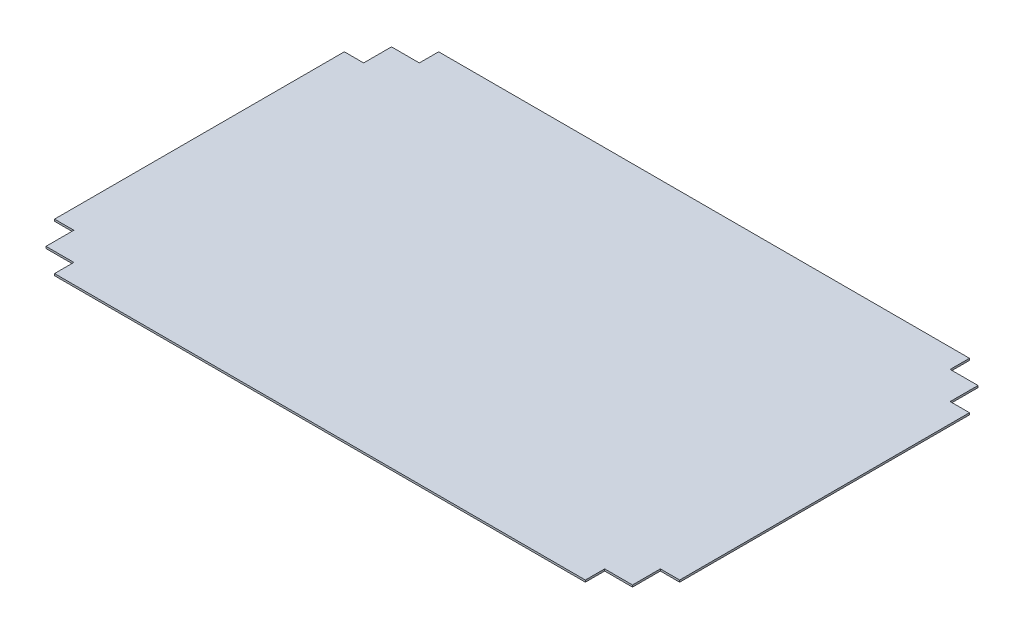
ISO-10303-21;
HEADER;
FILE_DESCRIPTION(('STEP AP214'),'2;1');
FILE_NAME('part.step','',(''),(''),'','','');
FILE_SCHEMA(('AUTOMOTIVE_DESIGN { 1 0 10303 214 1 1 1 1 }'));
ENDSEC;
DATA;
#1=APPLICATION_CONTEXT('core data for automotive mechanical design processes');
#2=APPLICATION_PROTOCOL_DEFINITION('international standard','automotive_design',2000,#1);
#3=PRODUCT_CONTEXT('',#1,'mechanical');
#4=PRODUCT('Part','Part','',(#3));
#5=PRODUCT_RELATED_PRODUCT_CATEGORY('part','',(#4));
#6=PRODUCT_DEFINITION_FORMATION('','',#4);
#7=PRODUCT_DEFINITION_CONTEXT('part definition',#1,'design');
#8=PRODUCT_DEFINITION('design','',#6,#7);
#9=PRODUCT_DEFINITION_SHAPE('','',#8);
#10=(LENGTH_UNIT() NAMED_UNIT(*) SI_UNIT(.MILLI.,.METRE.));
#11=(NAMED_UNIT(*) PLANE_ANGLE_UNIT() SI_UNIT($,.RADIAN.));
#12=(NAMED_UNIT(*) SI_UNIT($,.STERADIAN.) SOLID_ANGLE_UNIT());
#13=UNCERTAINTY_MEASURE_WITH_UNIT(LENGTH_MEASURE(1.E-05),#10,'distance_accuracy_value','');
#14=(GEOMETRIC_REPRESENTATION_CONTEXT(3) GLOBAL_UNCERTAINTY_ASSIGNED_CONTEXT((#13)) GLOBAL_UNIT_ASSIGNED_CONTEXT((#10,
#11,#12)) REPRESENTATION_CONTEXT('',''));
#15=CARTESIAN_POINT('',(0.,0.,0.));
#16=DIRECTION('',(0.,0.,1.));
#17=DIRECTION('',(1.,0.,0.));
#18=AXIS2_PLACEMENT_3D('',#15,#16,#17);
#19=CARTESIAN_POINT('',(-325.499342602982,2.,150.901091601542));
#20=DIRECTION('',(1.,0.,0.));
#21=DIRECTION('',(0.,0.,-1.));
#22=AXIS2_PLACEMENT_3D('',#19,#20,#21);
#23=PLANE('',#22);
#24=DIRECTION('',(0.,0.,1.));
#25=VECTOR('',#24,1.);
#26=CARTESIAN_POINT('',(-325.499342602982,0.,150.901091601542));
#27=LINE('',#26,#25);
#28=CARTESIAN_POINT('',(-325.499342602982,0.,-150.901111001535));
#29=VERTEX_POINT('',#28);
#30=CARTESIAN_POINT('',(-325.499342602982,0.,150.901091601542));
#31=VERTEX_POINT('',#30);
#32=EDGE_CURVE('E202',#29,#31,#27,.T.);
#33=ORIENTED_EDGE('',*,*,#32,.T.);
#34=DIRECTION('',(0.,-1.,0.));
#35=VECTOR('',#34,1.);
#36=CARTESIAN_POINT('',(-325.499342602982,2.,150.901091601542));
#37=LINE('',#36,#35);
#38=CARTESIAN_POINT('',(-325.499342602982,2.,150.901091601542));
#39=VERTEX_POINT('',#38);
#40=EDGE_CURVE('E11',#39,#31,#37,.T.);
#41=ORIENTED_EDGE('',*,*,#40,.F.);
#42=DIRECTION('',(0.,0.,1.));
#43=VECTOR('',#42,1.);
#44=CARTESIAN_POINT('',(-325.499342602982,2.,150.901091601542));
#45=LINE('',#44,#43);
#46=CARTESIAN_POINT('',(-325.499342602982,2.,-150.901111001535));
#47=VERTEX_POINT('',#46);
#48=EDGE_CURVE('E241',#47,#39,#45,.T.);
#49=ORIENTED_EDGE('',*,*,#48,.F.);
#50=DIRECTION('',(0.,-1.,0.));
#51=VECTOR('',#50,1.);
#52=CARTESIAN_POINT('',(-325.499342602982,2.,-150.901111001535));
#53=LINE('',#52,#51);
#54=EDGE_CURVE('E198',#47,#29,#53,.T.);
#55=ORIENTED_EDGE('',*,*,#54,.T.);
#56=EDGE_LOOP('',(#33,#41,#49,#55));
#57=FACE_BOUND('',#56,.T.);
#58=ADVANCED_FACE('F33',(#57),#23,.F.);
#59=CARTESIAN_POINT('',(-305.400657397017,2.,150.901091601542));
#60=DIRECTION('',(0.,0.,-1.));
#61=DIRECTION('',(-1.,0.,0.));
#62=AXIS2_PLACEMENT_3D('',#59,#60,#61);
#63=PLANE('',#62);
#64=DIRECTION('',(1.,0.,0.));
#65=VECTOR('',#64,1.);
#66=CARTESIAN_POINT('',(-305.400657397017,0.,150.901091601542));
#67=LINE('',#66,#65);
#68=CARTESIAN_POINT('',(-305.400657397017,0.,150.901091601542));
#69=VERTEX_POINT('',#68);
#70=EDGE_CURVE('E205',#31,#69,#67,.T.);
#71=ORIENTED_EDGE('',*,*,#70,.T.);
#72=DIRECTION('',(0.,-1.,0.));
#73=VECTOR('',#72,1.);
#74=CARTESIAN_POINT('',(-305.400657397017,2.,150.901091601542));
#75=LINE('',#74,#73);
#76=CARTESIAN_POINT('',(-305.400657397017,2.,150.901091601542));
#77=VERTEX_POINT('',#76);
#78=EDGE_CURVE('E41',#77,#69,#75,.T.);
#79=ORIENTED_EDGE('',*,*,#78,.F.);
#80=DIRECTION('',(1.,0.,0.));
#81=VECTOR('',#80,1.);
#82=CARTESIAN_POINT('',(-305.400657397017,2.,150.901091601542));
#83=LINE('',#82,#81);
#84=EDGE_CURVE('E126',#39,#77,#83,.T.);
#85=ORIENTED_EDGE('',*,*,#84,.F.);
#86=ORIENTED_EDGE('',*,*,#40,.T.);
#87=EDGE_LOOP('',(#71,#79,#85,#86));
#88=FACE_BOUND('',#87,.T.);
#89=ADVANCED_FACE('F349',(#88),#63,.F.);
#90=CARTESIAN_POINT('',(-305.400657397017,2.,179.901091601542));
#91=DIRECTION('',(1.,0.,0.));
#92=DIRECTION('',(0.,0.,-1.));
#93=AXIS2_PLACEMENT_3D('',#90,#91,#92);
#94=PLANE('',#93);
#95=DIRECTION('',(0.,0.,1.));
#96=VECTOR('',#95,1.);
#97=CARTESIAN_POINT('',(-305.400657397017,0.,179.901091601542));
#98=LINE('',#97,#96);
#99=CARTESIAN_POINT('',(-305.400657397017,0.,179.901091601542));
#100=VERTEX_POINT('',#99);
#101=EDGE_CURVE('E207',#69,#100,#98,.T.);
#102=ORIENTED_EDGE('',*,*,#101,.T.);
#103=DIRECTION('',(0.,-1.,0.));
#104=VECTOR('',#103,1.);
#105=CARTESIAN_POINT('',(-305.400657397017,2.,179.901091601542));
#106=LINE('',#105,#104);
#107=CARTESIAN_POINT('',(-305.400657397017,2.,179.901091601542));
#108=VERTEX_POINT('',#107);
#109=EDGE_CURVE('E284',#108,#100,#106,.T.);
#110=ORIENTED_EDGE('',*,*,#109,.F.);
#111=DIRECTION('',(0.,0.,1.));
#112=VECTOR('',#111,1.);
#113=CARTESIAN_POINT('',(-305.400657397017,2.,179.901091601542));
#114=LINE('',#113,#112);
#115=EDGE_CURVE('E292',#77,#108,#114,.T.);
#116=ORIENTED_EDGE('',*,*,#115,.F.);
#117=ORIENTED_EDGE('',*,*,#78,.T.);
#118=EDGE_LOOP('',(#102,#110,#116,#117));
#119=FACE_BOUND('',#118,.T.);
#120=ADVANCED_FACE('F290',(#119),#94,.F.);
#121=CARTESIAN_POINT('',(-276.400657397017,2.,179.901091601542));
#122=DIRECTION('',(0.,0.,-1.));
#123=DIRECTION('',(-1.,0.,0.));
#124=AXIS2_PLACEMENT_3D('',#121,#122,#123);
#125=PLANE('',#124);
#126=DIRECTION('',(1.,0.,0.));
#127=VECTOR('',#126,1.);
#128=CARTESIAN_POINT('',(-276.400657397017,0.,179.901091601542));
#129=LINE('',#128,#127);
#130=CARTESIAN_POINT('',(-276.400657397017,0.,179.901091601542));
#131=VERTEX_POINT('',#130);
#132=EDGE_CURVE('E209',#100,#131,#129,.T.);
#133=ORIENTED_EDGE('',*,*,#132,.T.);
#134=DIRECTION('',(0.,-1.,0.));
#135=VECTOR('',#134,1.);
#136=CARTESIAN_POINT('',(-276.400657397017,2.,179.901091601542));
#137=LINE('',#136,#135);
#138=CARTESIAN_POINT('',(-276.400657397017,2.,179.901091601542));
#139=VERTEX_POINT('',#138);
#140=EDGE_CURVE('E281',#139,#131,#137,.T.);
#141=ORIENTED_EDGE('',*,*,#140,.F.);
#142=DIRECTION('',(1.,0.,0.));
#143=VECTOR('',#142,1.);
#144=CARTESIAN_POINT('',(-276.400657397017,2.,179.901091601542));
#145=LINE('',#144,#143);
#146=EDGE_CURVE('E308',#108,#139,#145,.T.);
#147=ORIENTED_EDGE('',*,*,#146,.F.);
#148=ORIENTED_EDGE('',*,*,#109,.T.);
#149=EDGE_LOOP('',(#133,#141,#147,#148));
#150=FACE_BOUND('',#149,.T.);
#151=ADVANCED_FACE('F299',(#150),#125,.F.);
#152=CARTESIAN_POINT('',(-276.400657397017,2.,199.998908398458));
#153=DIRECTION('',(1.,0.,0.));
#154=DIRECTION('',(0.,0.,-1.));
#155=AXIS2_PLACEMENT_3D('',#152,#153,#154);
#156=PLANE('',#155);
#157=DIRECTION('',(0.,0.,1.));
#158=VECTOR('',#157,1.);
#159=CARTESIAN_POINT('',(-276.400657397017,0.,199.998908398458));
#160=LINE('',#159,#158);
#161=CARTESIAN_POINT('',(-276.400657397017,0.,199.998908398458));
#162=VERTEX_POINT('',#161);
#163=EDGE_CURVE('E211',#131,#162,#160,.T.);
#164=ORIENTED_EDGE('',*,*,#163,.T.);
#165=DIRECTION('',(0.,-1.,0.));
#166=VECTOR('',#165,1.);
#167=CARTESIAN_POINT('',(-276.400657397017,2.,199.998908398458));
#168=LINE('',#167,#166);
#169=CARTESIAN_POINT('',(-276.400657397017,2.,199.998908398458));
#170=VERTEX_POINT('',#169);
#171=EDGE_CURVE('E278',#170,#162,#168,.T.);
#172=ORIENTED_EDGE('',*,*,#171,.F.);
#173=DIRECTION('',(0.,0.,1.));
#174=VECTOR('',#173,1.);
#175=CARTESIAN_POINT('',(-276.400657397017,2.,199.998908398458));
#176=LINE('',#175,#174);
#177=EDGE_CURVE('E305',#139,#170,#176,.T.);
#178=ORIENTED_EDGE('',*,*,#177,.F.);
#179=ORIENTED_EDGE('',*,*,#140,.T.);
#180=EDGE_LOOP('',(#164,#172,#178,#179));
#181=FACE_BOUND('',#180,.T.);
#182=ADVANCED_FACE('F303',(#181),#156,.F.);
#183=CARTESIAN_POINT('',(276.400657397018,2.,199.998908398458));
#184=DIRECTION('',(0.,0.,-1.));
#185=DIRECTION('',(-1.,0.,0.));
#186=AXIS2_PLACEMENT_3D('',#183,#184,#185);
#187=PLANE('',#186);
#188=DIRECTION('',(1.,0.,0.));
#189=VECTOR('',#188,1.);
#190=CARTESIAN_POINT('',(276.400657397018,0.,199.998908398458));
#191=LINE('',#190,#189);
#192=CARTESIAN_POINT('',(276.400657397018,0.,199.998908398458));
#193=VERTEX_POINT('',#192);
#194=EDGE_CURVE('E213',#162,#193,#191,.T.);
#195=ORIENTED_EDGE('',*,*,#194,.T.);
#196=DIRECTION('',(0.,-1.,0.));
#197=VECTOR('',#196,1.);
#198=CARTESIAN_POINT('',(276.400657397018,2.,199.998908398458));
#199=LINE('',#198,#197);
#200=CARTESIAN_POINT('',(276.400657397018,2.,199.998908398458));
#201=VERTEX_POINT('',#200);
#202=EDGE_CURVE('E275',#201,#193,#199,.T.);
#203=ORIENTED_EDGE('',*,*,#202,.F.);
#204=DIRECTION('',(1.,0.,0.));
#205=VECTOR('',#204,1.);
#206=CARTESIAN_POINT('',(276.400657397018,2.,199.998908398458));
#207=LINE('',#206,#205);
#208=EDGE_CURVE('E307',#170,#201,#207,.T.);
#209=ORIENTED_EDGE('',*,*,#208,.F.);
#210=ORIENTED_EDGE('',*,*,#171,.T.);
#211=EDGE_LOOP('',(#195,#203,#209,#210));
#212=FACE_BOUND('',#211,.T.);
#213=ADVANCED_FACE('F361',(#212),#187,.F.);
#214=CARTESIAN_POINT('',(276.400657397018,2.,179.901091601542));
#215=DIRECTION('',(-1.,0.,0.));
#216=DIRECTION('',(0.,0.,1.));
#217=AXIS2_PLACEMENT_3D('',#214,#215,#216);
#218=PLANE('',#217);
#219=DIRECTION('',(0.,0.,-1.));
#220=VECTOR('',#219,1.);
#221=CARTESIAN_POINT('',(276.400657397018,0.,179.901091601542));
#222=LINE('',#221,#220);
#223=CARTESIAN_POINT('',(276.400657397018,0.,179.901091601542));
#224=VERTEX_POINT('',#223);
#225=EDGE_CURVE('E215',#193,#224,#222,.T.);
#226=ORIENTED_EDGE('',*,*,#225,.T.);
#227=DIRECTION('',(0.,-1.,0.));
#228=VECTOR('',#227,1.);
#229=CARTESIAN_POINT('',(276.400657397018,2.,179.901091601542));
#230=LINE('',#229,#228);
#231=CARTESIAN_POINT('',(276.400657397018,2.,179.901091601542));
#232=VERTEX_POINT('',#231);
#233=EDGE_CURVE('E272',#232,#224,#230,.T.);
#234=ORIENTED_EDGE('',*,*,#233,.F.);
#235=DIRECTION('',(0.,0.,-1.));
#236=VECTOR('',#235,1.);
#237=CARTESIAN_POINT('',(276.400657397018,2.,179.901091601542));
#238=LINE('',#237,#236);
#239=EDGE_CURVE('E310',#201,#232,#238,.T.);
#240=ORIENTED_EDGE('',*,*,#239,.F.);
#241=ORIENTED_EDGE('',*,*,#202,.T.);
#242=EDGE_LOOP('',(#226,#234,#240,#241));
#243=FACE_BOUND('',#242,.T.);
#244=ADVANCED_FACE('F364',(#243),#218,.F.);
#245=CARTESIAN_POINT('',(305.400657397018,2.,179.901091601542));
#246=DIRECTION('',(0.,0.,-1.));
#247=DIRECTION('',(-1.,0.,0.));
#248=AXIS2_PLACEMENT_3D('',#245,#246,#247);
#249=PLANE('',#248);
#250=DIRECTION('',(1.,0.,0.));
#251=VECTOR('',#250,1.);
#252=CARTESIAN_POINT('',(305.400657397018,0.,179.901091601542));
#253=LINE('',#252,#251);
#254=CARTESIAN_POINT('',(305.400657397018,0.,179.901091601542));
#255=VERTEX_POINT('',#254);
#256=EDGE_CURVE('E217',#224,#255,#253,.T.);
#257=ORIENTED_EDGE('',*,*,#256,.T.);
#258=DIRECTION('',(0.,-1.,0.));
#259=VECTOR('',#258,1.);
#260=CARTESIAN_POINT('',(305.400657397018,2.,179.901091601542));
#261=LINE('',#260,#259);
#262=CARTESIAN_POINT('',(305.400657397018,2.,179.901091601542));
#263=VERTEX_POINT('',#262);
#264=EDGE_CURVE('E269',#263,#255,#261,.T.);
#265=ORIENTED_EDGE('',*,*,#264,.F.);
#266=DIRECTION('',(1.,0.,0.));
#267=VECTOR('',#266,1.);
#268=CARTESIAN_POINT('',(305.400657397018,2.,179.901091601542));
#269=LINE('',#268,#267);
#270=EDGE_CURVE('E316',#232,#263,#269,.T.);
#271=ORIENTED_EDGE('',*,*,#270,.F.);
#272=ORIENTED_EDGE('',*,*,#233,.T.);
#273=EDGE_LOOP('',(#257,#265,#271,#272));
#274=FACE_BOUND('',#273,.T.);
#275=ADVANCED_FACE('F368',(#274),#249,.F.);
#276=CARTESIAN_POINT('',(305.400657397018,2.,150.901091601542));
#277=DIRECTION('',(-1.,0.,0.));
#278=DIRECTION('',(0.,0.,1.));
#279=AXIS2_PLACEMENT_3D('',#276,#277,#278);
#280=PLANE('',#279);
#281=DIRECTION('',(0.,0.,-1.));
#282=VECTOR('',#281,1.);
#283=CARTESIAN_POINT('',(305.400657397018,0.,150.901091601542));
#284=LINE('',#283,#282);
#285=CARTESIAN_POINT('',(305.400657397018,0.,150.901091601542));
#286=VERTEX_POINT('',#285);
#287=EDGE_CURVE('E219',#255,#286,#284,.T.);
#288=ORIENTED_EDGE('',*,*,#287,.T.);
#289=DIRECTION('',(0.,-1.,0.));
#290=VECTOR('',#289,1.);
#291=CARTESIAN_POINT('',(305.400657397018,2.,150.901091601542));
#292=LINE('',#291,#290);
#293=CARTESIAN_POINT('',(305.400657397018,2.,150.901091601542));
#294=VERTEX_POINT('',#293);
#295=EDGE_CURVE('E266',#294,#286,#292,.T.);
#296=ORIENTED_EDGE('',*,*,#295,.F.);
#297=DIRECTION('',(0.,0.,-1.));
#298=VECTOR('',#297,1.);
#299=CARTESIAN_POINT('',(305.400657397018,2.,150.901091601542));
#300=LINE('',#299,#298);
#301=EDGE_CURVE('E318',#263,#294,#300,.T.);
#302=ORIENTED_EDGE('',*,*,#301,.F.);
#303=ORIENTED_EDGE('',*,*,#264,.T.);
#304=EDGE_LOOP('',(#288,#296,#302,#303));
#305=FACE_BOUND('',#304,.T.);
#306=ADVANCED_FACE('F372',(#305),#280,.F.);
#307=CARTESIAN_POINT('',(325.499342602982,2.,150.901091601542));
#308=DIRECTION('',(0.,0.,-1.));
#309=DIRECTION('',(-1.,0.,0.));
#310=AXIS2_PLACEMENT_3D('',#307,#308,#309);
#311=PLANE('',#310);
#312=DIRECTION('',(1.,0.,0.));
#313=VECTOR('',#312,1.);
#314=CARTESIAN_POINT('',(325.499342602982,0.,150.901091601542));
#315=LINE('',#314,#313);
#316=CARTESIAN_POINT('',(325.499342602982,0.,150.901091601542));
#317=VERTEX_POINT('',#316);
#318=EDGE_CURVE('E221',#286,#317,#315,.T.);
#319=ORIENTED_EDGE('',*,*,#318,.T.);
#320=DIRECTION('',(0.,-1.,0.));
#321=VECTOR('',#320,1.);
#322=CARTESIAN_POINT('',(325.499342602982,2.,150.901091601542));
#323=LINE('',#322,#321);
#324=CARTESIAN_POINT('',(325.499342602982,2.,150.901091601542));
#325=VERTEX_POINT('',#324);
#326=EDGE_CURVE('E263',#325,#317,#323,.T.);
#327=ORIENTED_EDGE('',*,*,#326,.F.);
#328=DIRECTION('',(1.,0.,0.));
#329=VECTOR('',#328,1.);
#330=CARTESIAN_POINT('',(325.499342602982,2.,150.901091601542));
#331=LINE('',#330,#329);
#332=EDGE_CURVE('E320',#294,#325,#331,.T.);
#333=ORIENTED_EDGE('',*,*,#332,.F.);
#334=ORIENTED_EDGE('',*,*,#295,.T.);
#335=EDGE_LOOP('',(#319,#327,#333,#334));
#336=FACE_BOUND('',#335,.T.);
#337=ADVANCED_FACE('F376',(#336),#311,.F.);
#338=CARTESIAN_POINT('',(325.499342602982,2.,-150.901111001536));
#339=DIRECTION('',(-1.,0.,0.));
#340=DIRECTION('',(0.,0.,1.));
#341=AXIS2_PLACEMENT_3D('',#338,#339,#340);
#342=PLANE('',#341);
#343=DIRECTION('',(0.,0.,-1.));
#344=VECTOR('',#343,1.);
#345=CARTESIAN_POINT('',(325.499342602982,0.,-150.901111001536));
#346=LINE('',#345,#344);
#347=CARTESIAN_POINT('',(325.499342602982,0.,-150.901111001536));
#348=VERTEX_POINT('',#347);
#349=EDGE_CURVE('E223',#317,#348,#346,.T.);
#350=ORIENTED_EDGE('',*,*,#349,.T.);
#351=DIRECTION('',(0.,-1.,0.));
#352=VECTOR('',#351,1.);
#353=CARTESIAN_POINT('',(325.499342602982,2.,-150.901111001536));
#354=LINE('',#353,#352);
#355=CARTESIAN_POINT('',(325.499342602982,2.,-150.901111001536));
#356=VERTEX_POINT('',#355);
#357=EDGE_CURVE('E260',#356,#348,#354,.T.);
#358=ORIENTED_EDGE('',*,*,#357,.F.);
#359=DIRECTION('',(0.,0.,-1.));
#360=VECTOR('',#359,1.);
#361=CARTESIAN_POINT('',(325.499342602982,2.,-150.901111001536));
#362=LINE('',#361,#360);
#363=EDGE_CURVE('E322',#325,#356,#362,.T.);
#364=ORIENTED_EDGE('',*,*,#363,.F.);
#365=ORIENTED_EDGE('',*,*,#326,.T.);
#366=EDGE_LOOP('',(#350,#358,#364,#365));
#367=FACE_BOUND('',#366,.T.);
#368=ADVANCED_FACE('F380',(#367),#342,.F.);
#369=CARTESIAN_POINT('',(305.400657397018,2.,-150.901111001536));
#370=DIRECTION('',(0.,0.,1.));
#371=DIRECTION('',(1.,0.,0.));
#372=AXIS2_PLACEMENT_3D('',#369,#370,#371);
#373=PLANE('',#372);
#374=DIRECTION('',(-1.,0.,0.));
#375=VECTOR('',#374,1.);
#376=CARTESIAN_POINT('',(305.400657397018,0.,-150.901111001536));
#377=LINE('',#376,#375);
#378=CARTESIAN_POINT('',(305.400657397018,0.,-150.901111001536));
#379=VERTEX_POINT('',#378);
#380=EDGE_CURVE('E225',#348,#379,#377,.T.);
#381=ORIENTED_EDGE('',*,*,#380,.T.);
#382=DIRECTION('',(0.,-1.,0.));
#383=VECTOR('',#382,1.);
#384=CARTESIAN_POINT('',(305.400657397018,2.,-150.901111001536));
#385=LINE('',#384,#383);
#386=CARTESIAN_POINT('',(305.400657397018,2.,-150.901111001536));
#387=VERTEX_POINT('',#386);
#388=EDGE_CURVE('E257',#387,#379,#385,.T.);
#389=ORIENTED_EDGE('',*,*,#388,.F.);
#390=DIRECTION('',(-1.,0.,0.));
#391=VECTOR('',#390,1.);
#392=CARTESIAN_POINT('',(305.400657397018,2.,-150.901111001536));
#393=LINE('',#392,#391);
#394=EDGE_CURVE('E324',#356,#387,#393,.T.);
#395=ORIENTED_EDGE('',*,*,#394,.F.);
#396=ORIENTED_EDGE('',*,*,#357,.T.);
#397=EDGE_LOOP('',(#381,#389,#395,#396));
#398=FACE_BOUND('',#397,.T.);
#399=ADVANCED_FACE('F384',(#398),#373,.F.);
#400=CARTESIAN_POINT('',(305.400657397018,2.,-179.901111001535));
#401=DIRECTION('',(-1.,0.,0.));
#402=DIRECTION('',(0.,0.,1.));
#403=AXIS2_PLACEMENT_3D('',#400,#401,#402);
#404=PLANE('',#403);
#405=DIRECTION('',(0.,0.,-1.));
#406=VECTOR('',#405,1.);
#407=CARTESIAN_POINT('',(305.400657397018,0.,-179.901111001535));
#408=LINE('',#407,#406);
#409=CARTESIAN_POINT('',(305.400657397018,0.,-179.901111001535));
#410=VERTEX_POINT('',#409);
#411=EDGE_CURVE('E227',#379,#410,#408,.T.);
#412=ORIENTED_EDGE('',*,*,#411,.T.);
#413=DIRECTION('',(0.,-1.,0.));
#414=VECTOR('',#413,1.);
#415=CARTESIAN_POINT('',(305.400657397018,2.,-179.901111001535));
#416=LINE('',#415,#414);
#417=CARTESIAN_POINT('',(305.400657397018,2.,-179.901111001535));
#418=VERTEX_POINT('',#417);
#419=EDGE_CURVE('E254',#418,#410,#416,.T.);
#420=ORIENTED_EDGE('',*,*,#419,.F.);
#421=DIRECTION('',(0.,0.,-1.));
#422=VECTOR('',#421,1.);
#423=CARTESIAN_POINT('',(305.400657397018,2.,-179.901111001535));
#424=LINE('',#423,#422);
#425=EDGE_CURVE('E326',#387,#418,#424,.T.);
#426=ORIENTED_EDGE('',*,*,#425,.F.);
#427=ORIENTED_EDGE('',*,*,#388,.T.);
#428=EDGE_LOOP('',(#412,#420,#426,#427));
#429=FACE_BOUND('',#428,.T.);
#430=ADVANCED_FACE('F388',(#429),#404,.F.);
#431=CARTESIAN_POINT('',(276.400657397018,2.,-179.901111001535));
#432=DIRECTION('',(0.,0.,1.));
#433=DIRECTION('',(1.,0.,0.));
#434=AXIS2_PLACEMENT_3D('',#431,#432,#433);
#435=PLANE('',#434);
#436=DIRECTION('',(-1.,0.,0.));
#437=VECTOR('',#436,1.);
#438=CARTESIAN_POINT('',(276.400657397018,0.,-179.901111001535));
#439=LINE('',#438,#437);
#440=CARTESIAN_POINT('',(276.400657397018,0.,-179.901111001535));
#441=VERTEX_POINT('',#440);
#442=EDGE_CURVE('E229',#410,#441,#439,.T.);
#443=ORIENTED_EDGE('',*,*,#442,.T.);
#444=DIRECTION('',(0.,-1.,0.));
#445=VECTOR('',#444,1.);
#446=CARTESIAN_POINT('',(276.400657397018,2.,-179.901111001535));
#447=LINE('',#446,#445);
#448=CARTESIAN_POINT('',(276.400657397018,2.,-179.901111001535));
#449=VERTEX_POINT('',#448);
#450=EDGE_CURVE('E251',#449,#441,#447,.T.);
#451=ORIENTED_EDGE('',*,*,#450,.F.);
#452=DIRECTION('',(-1.,0.,0.));
#453=VECTOR('',#452,1.);
#454=CARTESIAN_POINT('',(276.400657397018,2.,-179.901111001535));
#455=LINE('',#454,#453);
#456=EDGE_CURVE('E328',#418,#449,#455,.T.);
#457=ORIENTED_EDGE('',*,*,#456,.F.);
#458=ORIENTED_EDGE('',*,*,#419,.T.);
#459=EDGE_LOOP('',(#443,#451,#457,#458));
#460=FACE_BOUND('',#459,.T.);
#461=ADVANCED_FACE('F392',(#460),#435,.F.);
#462=CARTESIAN_POINT('',(276.400657397018,2.,-199.998908398458));
#463=DIRECTION('',(-1.,0.,0.));
#464=DIRECTION('',(0.,0.,1.));
#465=AXIS2_PLACEMENT_3D('',#462,#463,#464);
#466=PLANE('',#465);
#467=DIRECTION('',(0.,0.,-1.));
#468=VECTOR('',#467,1.);
#469=CARTESIAN_POINT('',(276.400657397018,0.,-199.998908398458));
#470=LINE('',#469,#468);
#471=CARTESIAN_POINT('',(276.400657397018,0.,-199.998908398458));
#472=VERTEX_POINT('',#471);
#473=EDGE_CURVE('E231',#441,#472,#470,.T.);
#474=ORIENTED_EDGE('',*,*,#473,.T.);
#475=DIRECTION('',(0.,-1.,0.));
#476=VECTOR('',#475,1.);
#477=CARTESIAN_POINT('',(276.400657397018,2.,-199.998908398458));
#478=LINE('',#477,#476);
#479=CARTESIAN_POINT('',(276.400657397018,2.,-199.998908398458));
#480=VERTEX_POINT('',#479);
#481=EDGE_CURVE('E248',#480,#472,#478,.T.);
#482=ORIENTED_EDGE('',*,*,#481,.F.);
#483=DIRECTION('',(0.,0.,-1.));
#484=VECTOR('',#483,1.);
#485=CARTESIAN_POINT('',(276.400657397018,2.,-199.998908398458));
#486=LINE('',#485,#484);
#487=EDGE_CURVE('E330',#449,#480,#486,.T.);
#488=ORIENTED_EDGE('',*,*,#487,.F.);
#489=ORIENTED_EDGE('',*,*,#450,.T.);
#490=EDGE_LOOP('',(#474,#482,#488,#489));
#491=FACE_BOUND('',#490,.T.);
#492=ADVANCED_FACE('F396',(#491),#466,.F.);
#493=CARTESIAN_POINT('',(-276.400657397017,2.,-199.998908398458));
#494=DIRECTION('',(0.,0.,1.));
#495=DIRECTION('',(1.,0.,0.));
#496=AXIS2_PLACEMENT_3D('',#493,#494,#495);
#497=PLANE('',#496);
#498=DIRECTION('',(-1.,0.,0.));
#499=VECTOR('',#498,1.);
#500=CARTESIAN_POINT('',(-276.400657397017,0.,-199.998908398458));
#501=LINE('',#500,#499);
#502=CARTESIAN_POINT('',(-276.400657397017,0.,-199.998908398458));
#503=VERTEX_POINT('',#502);
#504=EDGE_CURVE('E233',#472,#503,#501,.T.);
#505=ORIENTED_EDGE('',*,*,#504,.T.);
#506=DIRECTION('',(0.,-1.,0.));
#507=VECTOR('',#506,1.);
#508=CARTESIAN_POINT('',(-276.400657397017,2.,-199.998908398458));
#509=LINE('',#508,#507);
#510=CARTESIAN_POINT('',(-276.400657397017,2.,-199.998908398458));
#511=VERTEX_POINT('',#510);
#512=EDGE_CURVE('E245',#511,#503,#509,.T.);
#513=ORIENTED_EDGE('',*,*,#512,.F.);
#514=DIRECTION('',(-1.,0.,0.));
#515=VECTOR('',#514,1.);
#516=CARTESIAN_POINT('',(-276.400657397017,2.,-199.998908398458));
#517=LINE('',#516,#515);
#518=EDGE_CURVE('E332',#480,#511,#517,.T.);
#519=ORIENTED_EDGE('',*,*,#518,.F.);
#520=ORIENTED_EDGE('',*,*,#481,.T.);
#521=EDGE_LOOP('',(#505,#513,#519,#520));
#522=FACE_BOUND('',#521,.T.);
#523=ADVANCED_FACE('F338',(#522),#497,.F.);
#524=CARTESIAN_POINT('',(-276.400657397017,2.,-179.901111001535));
#525=DIRECTION('',(1.,0.,0.));
#526=DIRECTION('',(0.,0.,-1.));
#527=AXIS2_PLACEMENT_3D('',#524,#525,#526);
#528=PLANE('',#527);
#529=DIRECTION('',(0.,0.,1.));
#530=VECTOR('',#529,1.);
#531=CARTESIAN_POINT('',(-276.400657397017,0.,-179.901111001535));
#532=LINE('',#531,#530);
#533=CARTESIAN_POINT('',(-276.400657397017,0.,-179.901111001535));
#534=VERTEX_POINT('',#533);
#535=EDGE_CURVE('E235',#503,#534,#532,.T.);
#536=ORIENTED_EDGE('',*,*,#535,.T.);
#537=DIRECTION('',(0.,-1.,0.));
#538=VECTOR('',#537,1.);
#539=CARTESIAN_POINT('',(-276.400657397017,2.,-179.901111001535));
#540=LINE('',#539,#538);
#541=CARTESIAN_POINT('',(-276.400657397017,2.,-179.901111001535));
#542=VERTEX_POINT('',#541);
#543=EDGE_CURVE('E193',#542,#534,#540,.T.);
#544=ORIENTED_EDGE('',*,*,#543,.F.);
#545=DIRECTION('',(0.,0.,1.));
#546=VECTOR('',#545,1.);
#547=CARTESIAN_POINT('',(-276.400657397017,2.,-179.901111001535));
#548=LINE('',#547,#546);
#549=EDGE_CURVE('E182',#511,#542,#548,.T.);
#550=ORIENTED_EDGE('',*,*,#549,.F.);
#551=ORIENTED_EDGE('',*,*,#512,.T.);
#552=EDGE_LOOP('',(#536,#544,#550,#551));
#553=FACE_BOUND('',#552,.T.);
#554=ADVANCED_FACE('F342',(#553),#528,.F.);
#555=CARTESIAN_POINT('',(-305.400657397017,2.,-179.901111001535));
#556=DIRECTION('',(0.,0.,1.));
#557=DIRECTION('',(1.,0.,0.));
#558=AXIS2_PLACEMENT_3D('',#555,#556,#557);
#559=PLANE('',#558);
#560=DIRECTION('',(-1.,0.,0.));
#561=VECTOR('',#560,1.);
#562=CARTESIAN_POINT('',(-305.400657397017,0.,-179.901111001535));
#563=LINE('',#562,#561);
#564=CARTESIAN_POINT('',(-305.400657397017,0.,-179.901111001535));
#565=VERTEX_POINT('',#564);
#566=EDGE_CURVE('E191',#534,#565,#563,.T.);
#567=ORIENTED_EDGE('',*,*,#566,.T.);
#568=DIRECTION('',(0.,-1.,0.));
#569=VECTOR('',#568,1.);
#570=CARTESIAN_POINT('',(-305.400657397017,2.,-179.901111001535));
#571=LINE('',#570,#569);
#572=CARTESIAN_POINT('',(-305.400657397017,2.,-179.901111001535));
#573=VERTEX_POINT('',#572);
#574=EDGE_CURVE('E188',#573,#565,#571,.T.);
#575=ORIENTED_EDGE('',*,*,#574,.F.);
#576=DIRECTION('',(-1.,0.,0.));
#577=VECTOR('',#576,1.);
#578=CARTESIAN_POINT('',(-305.400657397017,2.,-179.901111001535));
#579=LINE('',#578,#577);
#580=EDGE_CURVE('E175',#542,#573,#579,.T.);
#581=ORIENTED_EDGE('',*,*,#580,.F.);
#582=ORIENTED_EDGE('',*,*,#543,.T.);
#583=EDGE_LOOP('',(#567,#575,#581,#582));
#584=FACE_BOUND('',#583,.T.);
#585=ADVANCED_FACE('F189',(#584),#559,.F.);
#586=CARTESIAN_POINT('',(-305.400657397017,2.,-150.901111001535));
#587=DIRECTION('',(1.,0.,0.));
#588=DIRECTION('',(0.,0.,-1.));
#589=AXIS2_PLACEMENT_3D('',#586,#587,#588);
#590=PLANE('',#589);
#591=DIRECTION('',(0.,0.,1.));
#592=VECTOR('',#591,1.);
#593=CARTESIAN_POINT('',(-305.400657397017,0.,-150.901111001535));
#594=LINE('',#593,#592);
#595=CARTESIAN_POINT('',(-305.400657397017,0.,-150.901111001535));
#596=VERTEX_POINT('',#595);
#597=EDGE_CURVE('E238',#565,#596,#594,.T.);
#598=ORIENTED_EDGE('',*,*,#597,.T.);
#599=DIRECTION('',(0.,-1.,0.));
#600=VECTOR('',#599,1.);
#601=CARTESIAN_POINT('',(-305.400657397017,2.,-150.901111001535));
#602=LINE('',#601,#600);
#603=CARTESIAN_POINT('',(-305.400657397017,2.,-150.901111001535));
#604=VERTEX_POINT('',#603);
#605=EDGE_CURVE('E194',#604,#596,#602,.T.);
#606=ORIENTED_EDGE('',*,*,#605,.F.);
#607=DIRECTION('',(0.,0.,1.));
#608=VECTOR('',#607,1.);
#609=CARTESIAN_POINT('',(-305.400657397017,2.,-150.901111001535));
#610=LINE('',#609,#608);
#611=EDGE_CURVE('E179',#573,#604,#610,.T.);
#612=ORIENTED_EDGE('',*,*,#611,.F.);
#613=ORIENTED_EDGE('',*,*,#574,.T.);
#614=EDGE_LOOP('',(#598,#606,#612,#613));
#615=FACE_BOUND('',#614,.T.);
#616=ADVANCED_FACE('F196',(#615),#590,.F.);
#617=CARTESIAN_POINT('',(-325.499342602982,2.,-150.901111001535));
#618=DIRECTION('',(0.,0.,1.));
#619=DIRECTION('',(1.,0.,0.));
#620=AXIS2_PLACEMENT_3D('',#617,#618,#619);
#621=PLANE('',#620);
#622=DIRECTION('',(-1.,0.,0.));
#623=VECTOR('',#622,1.);
#624=CARTESIAN_POINT('',(-325.499342602982,0.,-150.901111001535));
#625=LINE('',#624,#623);
#626=EDGE_CURVE('E114',#596,#29,#625,.T.);
#627=ORIENTED_EDGE('',*,*,#626,.T.);
#628=ORIENTED_EDGE('',*,*,#54,.F.);
#629=DIRECTION('',(-1.,0.,0.));
#630=VECTOR('',#629,1.);
#631=CARTESIAN_POINT('',(-307.000657397017,2.,-150.901111001535));
#632=LINE('',#631,#630);
#633=EDGE_CURVE('E49',#604,#47,#632,.T.);
#634=ORIENTED_EDGE('',*,*,#633,.F.);
#635=ORIENTED_EDGE('',*,*,#605,.T.);
#636=EDGE_LOOP('',(#627,#628,#634,#635));
#637=FACE_BOUND('',#636,.T.);
#638=ADVANCED_FACE('F343',(#637),#621,.F.);
#639=CARTESIAN_POINT('',(0.,2.,0.));
#640=DIRECTION('',(0.,-1.,0.));
#641=DIRECTION('',(0.,0.,-1.));
#642=AXIS2_PLACEMENT_3D('',#639,#640,#641);
#643=PLANE('',#642);
#644=ORIENTED_EDGE('',*,*,#48,.T.);
#645=ORIENTED_EDGE('',*,*,#84,.T.);
#646=ORIENTED_EDGE('',*,*,#115,.T.);
#647=ORIENTED_EDGE('',*,*,#146,.T.);
#648=ORIENTED_EDGE('',*,*,#177,.T.);
#649=ORIENTED_EDGE('',*,*,#208,.T.);
#650=ORIENTED_EDGE('',*,*,#239,.T.);
#651=ORIENTED_EDGE('',*,*,#270,.T.);
#652=ORIENTED_EDGE('',*,*,#301,.T.);
#653=ORIENTED_EDGE('',*,*,#332,.T.);
#654=ORIENTED_EDGE('',*,*,#363,.T.);
#655=ORIENTED_EDGE('',*,*,#394,.T.);
#656=ORIENTED_EDGE('',*,*,#425,.T.);
#657=ORIENTED_EDGE('',*,*,#456,.T.);
#658=ORIENTED_EDGE('',*,*,#487,.T.);
#659=ORIENTED_EDGE('',*,*,#518,.T.);
#660=ORIENTED_EDGE('',*,*,#549,.T.);
#661=ORIENTED_EDGE('',*,*,#580,.T.);
#662=ORIENTED_EDGE('',*,*,#611,.T.);
#663=ORIENTED_EDGE('',*,*,#633,.T.);
#664=EDGE_LOOP('',(#644,#645,#646,#647,#648,#649,#650,#651,#652,#653,#654,#655,#656,#657,#658,
#659,#660,#661,#662,#663));
#665=FACE_BOUND('',#664,.T.);
#666=ADVANCED_FACE('F177',(#665),#643,.F.);
#667=CARTESIAN_POINT('',(0.,0.,0.));
#668=DIRECTION('',(0.,-1.,0.));
#669=DIRECTION('',(0.,0.,-1.));
#670=AXIS2_PLACEMENT_3D('',#667,#668,#669);
#671=PLANE('',#670);
#672=ORIENTED_EDGE('',*,*,#32,.F.);
#673=ORIENTED_EDGE('',*,*,#626,.F.);
#674=ORIENTED_EDGE('',*,*,#597,.F.);
#675=ORIENTED_EDGE('',*,*,#566,.F.);
#676=ORIENTED_EDGE('',*,*,#535,.F.);
#677=ORIENTED_EDGE('',*,*,#504,.F.);
#678=ORIENTED_EDGE('',*,*,#473,.F.);
#679=ORIENTED_EDGE('',*,*,#442,.F.);
#680=ORIENTED_EDGE('',*,*,#411,.F.);
#681=ORIENTED_EDGE('',*,*,#380,.F.);
#682=ORIENTED_EDGE('',*,*,#349,.F.);
#683=ORIENTED_EDGE('',*,*,#318,.F.);
#684=ORIENTED_EDGE('',*,*,#287,.F.);
#685=ORIENTED_EDGE('',*,*,#256,.F.);
#686=ORIENTED_EDGE('',*,*,#225,.F.);
#687=ORIENTED_EDGE('',*,*,#194,.F.);
#688=ORIENTED_EDGE('',*,*,#163,.F.);
#689=ORIENTED_EDGE('',*,*,#132,.F.);
#690=ORIENTED_EDGE('',*,*,#101,.F.);
#691=ORIENTED_EDGE('',*,*,#70,.F.);
#692=EDGE_LOOP('',(#672,#673,#674,#675,#676,#677,#678,#679,#680,#681,#682,#683,#684,#685,#686,
#687,#688,#689,#690,#691));
#693=FACE_BOUND('',#692,.T.);
#694=ADVANCED_FACE('F294',(#693),#671,.T.);
#695=CLOSED_SHELL('',(#58,#89,#120,#151,#182,#213,#244,#275,#306,#337,#368,#399,#430,#461,#492,
#523,#554,#585,#616,#638,#666,#694));
#696=MANIFOLD_SOLID_BREP('B2',#695);
#697=ADVANCED_BREP_SHAPE_REPRESENTATION('',(#18,#696),#14);
#698=SHAPE_DEFINITION_REPRESENTATION(#9,#697);
ENDSEC;
END-ISO-10303-21;
